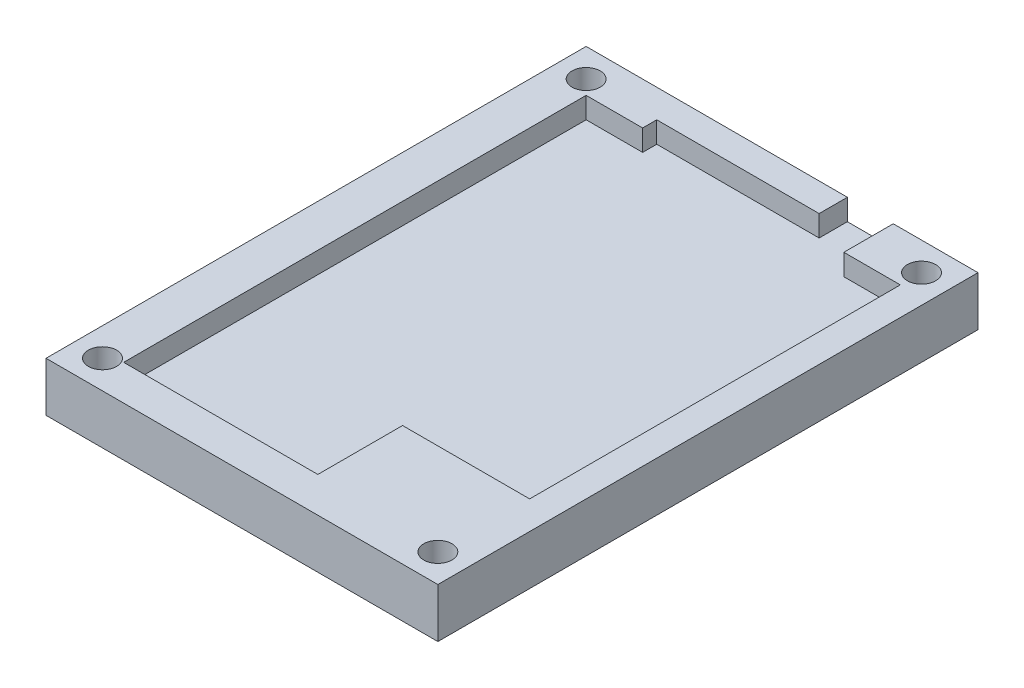
ISO-10303-21;
HEADER;
FILE_DESCRIPTION(('STEP AP214'),'2;1');
FILE_NAME('part.step','',(''),(''),'','','');
FILE_SCHEMA(('AUTOMOTIVE_DESIGN { 1 0 10303 214 1 1 1 1 }'));
ENDSEC;
DATA;
#1=APPLICATION_CONTEXT('core data for automotive mechanical design processes');
#2=APPLICATION_PROTOCOL_DEFINITION('international standard','automotive_design',2000,#1);
#3=PRODUCT_CONTEXT('',#1,'mechanical');
#4=PRODUCT('Part','Part','',(#3));
#5=PRODUCT_RELATED_PRODUCT_CATEGORY('part','',(#4));
#6=PRODUCT_DEFINITION_FORMATION('','',#4);
#7=PRODUCT_DEFINITION_CONTEXT('part definition',#1,'design');
#8=PRODUCT_DEFINITION('design','',#6,#7);
#9=PRODUCT_DEFINITION_SHAPE('','',#8);
#10=(LENGTH_UNIT() NAMED_UNIT(*) SI_UNIT(.MILLI.,.METRE.));
#11=(NAMED_UNIT(*) PLANE_ANGLE_UNIT() SI_UNIT($,.RADIAN.));
#12=(NAMED_UNIT(*) SI_UNIT($,.STERADIAN.) SOLID_ANGLE_UNIT());
#13=UNCERTAINTY_MEASURE_WITH_UNIT(LENGTH_MEASURE(1.E-05),#10,'distance_accuracy_value','');
#14=(GEOMETRIC_REPRESENTATION_CONTEXT(3) GLOBAL_UNCERTAINTY_ASSIGNED_CONTEXT((#13)) GLOBAL_UNIT_ASSIGNED_CONTEXT((#10,
#11,#12)) REPRESENTATION_CONTEXT('',''));
#15=CARTESIAN_POINT('',(0.,0.,0.));
#16=DIRECTION('',(0.,0.,1.));
#17=DIRECTION('',(1.,0.,0.));
#18=AXIS2_PLACEMENT_3D('',#15,#16,#17);
#19=CARTESIAN_POINT('',(0.,7.,0.));
#20=DIRECTION('',(0.,-1.,0.));
#21=DIRECTION('',(0.,0.,-1.));
#22=AXIS2_PLACEMENT_3D('',#19,#20,#21);
#23=PLANE('',#22);
#24=DIRECTION('',(-1.,0.,0.));
#25=VECTOR('',#24,1.);
#26=CARTESIAN_POINT('',(-21.4896030245747,7.,-26.2693761814745));
#27=LINE('',#26,#25);
#28=CARTESIAN_POINT('',(15.5103969754253,7.,-26.2693761814745));
#29=VERTEX_POINT('',#28);
#30=CARTESIAN_POINT('',(-21.4896030245747,7.,-26.2693761814745));
#31=VERTEX_POINT('',#30);
#32=EDGE_CURVE('E149',#29,#31,#27,.T.);
#33=ORIENTED_EDGE('',*,*,#32,.T.);
#34=DIRECTION('',(0.,0.,1.));
#35=VECTOR('',#34,1.);
#36=CARTESIAN_POINT('',(-21.4896030245747,7.,-26.2693761814745));
#37=LINE('',#36,#35);
#38=CARTESIAN_POINT('',(-21.4896030245747,7.,50.2306238185255));
#39=VERTEX_POINT('',#38);
#40=EDGE_CURVE('E160',#31,#39,#37,.T.);
#41=ORIENTED_EDGE('',*,*,#40,.T.);
#42=DIRECTION('',(1.,0.,0.));
#43=VECTOR('',#42,1.);
#44=CARTESIAN_POINT('',(-21.4896030245747,7.,50.2306238185255));
#45=LINE('',#44,#43);
#46=CARTESIAN_POINT('',(34.0103969754254,7.,50.2306238185255));
#47=VERTEX_POINT('',#46);
#48=EDGE_CURVE('E164',#39,#47,#45,.T.);
#49=ORIENTED_EDGE('',*,*,#48,.T.);
#50=DIRECTION('',(0.,0.,-1.));
#51=VECTOR('',#50,1.);
#52=CARTESIAN_POINT('',(34.0103969754254,7.,-26.2693761814745));
#53=LINE('',#52,#51);
#54=CARTESIAN_POINT('',(34.0103969754254,7.,-26.2693761814745));
#55=VERTEX_POINT('',#54);
#56=EDGE_CURVE('E177',#47,#55,#53,.T.);
#57=ORIENTED_EDGE('',*,*,#56,.T.);
#58=DIRECTION('',(-1.,0.,0.));
#59=VECTOR('',#58,1.);
#60=CARTESIAN_POINT('',(34.0103969754254,7.,-26.2693761814745));
#61=LINE('',#60,#59);
#62=CARTESIAN_POINT('',(22.0103969754254,7.,-26.2693761814745));
#63=VERTEX_POINT('',#62);
#64=EDGE_CURVE('E180',#55,#63,#61,.T.);
#65=ORIENTED_EDGE('',*,*,#64,.T.);
#66=DIRECTION('',(0.,0.,1.));
#67=VECTOR('',#66,1.);
#68=CARTESIAN_POINT('',(22.0103969754254,7.,-26.2693761814745));
#69=LINE('',#68,#67);
#70=CARTESIAN_POINT('',(22.0103969754254,7.,-19.2693761814745));
#71=VERTEX_POINT('',#70);
#72=EDGE_CURVE('E182',#63,#71,#69,.T.);
#73=ORIENTED_EDGE('',*,*,#72,.T.);
#74=DIRECTION('',(1.,0.,0.));
#75=VECTOR('',#74,1.);
#76=CARTESIAN_POINT('',(30.0103969754254,7.,-19.2693761814745));
#77=LINE('',#76,#75);
#78=CARTESIAN_POINT('',(30.0103969754254,7.,-19.2693761814745));
#79=VERTEX_POINT('',#78);
#80=EDGE_CURVE('E184',#71,#79,#77,.T.);
#81=ORIENTED_EDGE('',*,*,#80,.T.);
#82=DIRECTION('',(0.,0.,1.));
#83=VECTOR('',#82,1.);
#84=CARTESIAN_POINT('',(30.0103969754254,7.,33.2306238185255));
#85=LINE('',#84,#83);
#86=CARTESIAN_POINT('',(30.0103969754254,7.,33.2306238185255));
#87=VERTEX_POINT('',#86);
#88=EDGE_CURVE('E186',#79,#87,#85,.T.);
#89=ORIENTED_EDGE('',*,*,#88,.T.);
#90=DIRECTION('',(-1.,0.,0.));
#91=VECTOR('',#90,1.);
#92=CARTESIAN_POINT('',(30.0103969754254,7.,33.2306238185255));
#93=LINE('',#92,#91);
#94=CARTESIAN_POINT('',(12.0103969754254,7.,33.2306238185255));
#95=VERTEX_POINT('',#94);
#96=EDGE_CURVE('E188',#87,#95,#93,.T.);
#97=ORIENTED_EDGE('',*,*,#96,.T.);
#98=DIRECTION('',(0.,0.,1.));
#99=VECTOR('',#98,1.);
#100=CARTESIAN_POINT('',(12.0103969754254,7.,45.2306238185255));
#101=LINE('',#100,#99);
#102=CARTESIAN_POINT('',(12.0103969754254,7.,45.2306238185255));
#103=VERTEX_POINT('',#102);
#104=EDGE_CURVE('E190',#95,#103,#101,.T.);
#105=ORIENTED_EDGE('',*,*,#104,.T.);
#106=DIRECTION('',(-1.,0.,0.));
#107=VECTOR('',#106,1.);
#108=CARTESIAN_POINT('',(-15.4896030245747,7.,45.2306238185255));
#109=LINE('',#108,#107);
#110=CARTESIAN_POINT('',(-15.4896030245747,7.,45.2306238185255));
#111=VERTEX_POINT('',#110);
#112=EDGE_CURVE('E192',#103,#111,#109,.T.);
#113=ORIENTED_EDGE('',*,*,#112,.T.);
#114=DIRECTION('',(0.,0.,-1.));
#115=VECTOR('',#114,1.);
#116=CARTESIAN_POINT('',(-15.4896030245747,7.,-20.2693761814745));
#117=LINE('',#116,#115);
#118=CARTESIAN_POINT('',(-15.4896030245747,7.,-20.2693761814745));
#119=VERTEX_POINT('',#118);
#120=EDGE_CURVE('E194',#111,#119,#117,.T.);
#121=ORIENTED_EDGE('',*,*,#120,.T.);
#122=DIRECTION('',(1.,0.,0.));
#123=VECTOR('',#122,1.);
#124=CARTESIAN_POINT('',(-15.4896030245747,7.,-20.2693761814745));
#125=LINE('',#124,#123);
#126=CARTESIAN_POINT('',(-7.48960302457466,7.,-20.2693761814745));
#127=VERTEX_POINT('',#126);
#128=EDGE_CURVE('E196',#119,#127,#125,.T.);
#129=ORIENTED_EDGE('',*,*,#128,.T.);
#130=DIRECTION('',(0.,0.,-1.));
#131=VECTOR('',#130,1.);
#132=CARTESIAN_POINT('',(-7.48960302457466,7.,-22.2693761814745));
#133=LINE('',#132,#131);
#134=CARTESIAN_POINT('',(-7.48960302457466,7.,-22.2693761814745));
#135=VERTEX_POINT('',#134);
#136=EDGE_CURVE('E198',#127,#135,#133,.T.);
#137=ORIENTED_EDGE('',*,*,#136,.T.);
#138=DIRECTION('',(1.,0.,0.));
#139=VECTOR('',#138,1.);
#140=CARTESIAN_POINT('',(-7.48960302457466,7.,-22.2693761814745));
#141=LINE('',#140,#139);
#142=CARTESIAN_POINT('',(15.5103969754253,7.,-22.2693761814745));
#143=VERTEX_POINT('',#142);
#144=EDGE_CURVE('E200',#135,#143,#141,.T.);
#145=ORIENTED_EDGE('',*,*,#144,.T.);
#146=DIRECTION('',(0.,0.,-1.));
#147=VECTOR('',#146,1.);
#148=CARTESIAN_POINT('',(15.5103969754253,7.,-26.2693761814745));
#149=LINE('',#148,#147);
#150=EDGE_CURVE('E168',#143,#29,#149,.T.);
#151=ORIENTED_EDGE('',*,*,#150,.T.);
#152=EDGE_LOOP('',(#33,#41,#49,#57,#65,#73,#81,#89,#97,#105,#113,#121,#129,#137,#145,#151));
#153=FACE_BOUND('',#152,.T.);
#154=CARTESIAN_POINT('',(-17.4896030245747,7.,-22.2693761814745));
#155=DIRECTION('',(0.,1.,0.));
#156=DIRECTION('',(0.,0.,1.));
#157=AXIS2_PLACEMENT_3D('',#154,#155,#156);
#158=CIRCLE('',#157,1.99999999999999);
#159=CARTESIAN_POINT('',(-17.4896030245747,7.,-20.2693761814745));
#160=VERTEX_POINT('',#159);
#161=EDGE_CURVE('E378',#160,#160,#158,.T.);
#162=ORIENTED_EDGE('',*,*,#161,.F.);
#163=EDGE_LOOP('',(#162));
#164=FACE_BOUND('',#163,.T.);
#165=CARTESIAN_POINT('',(-17.4896030245747,7.,46.2306238185255));
#166=DIRECTION('',(0.,1.,0.));
#167=DIRECTION('',(0.,0.,1.));
#168=AXIS2_PLACEMENT_3D('',#165,#166,#167);
#169=CIRCLE('',#168,1.99999999999999);
#170=CARTESIAN_POINT('',(-17.4896030245747,7.,48.2306238185255));
#171=VERTEX_POINT('',#170);
#172=EDGE_CURVE('E373',#171,#171,#169,.T.);
#173=ORIENTED_EDGE('',*,*,#172,.F.);
#174=EDGE_LOOP('',(#173));
#175=FACE_BOUND('',#174,.T.);
#176=CARTESIAN_POINT('',(30.0103969754254,7.,46.2306238185255));
#177=DIRECTION('',(0.,1.,0.));
#178=DIRECTION('',(0.,0.,1.));
#179=AXIS2_PLACEMENT_3D('',#176,#177,#178);
#180=CIRCLE('',#179,1.99999999999999);
#181=CARTESIAN_POINT('',(30.0103969754254,7.,48.2306238185255));
#182=VERTEX_POINT('',#181);
#183=EDGE_CURVE('E365',#182,#182,#180,.T.);
#184=ORIENTED_EDGE('',*,*,#183,.F.);
#185=EDGE_LOOP('',(#184));
#186=FACE_BOUND('',#185,.T.);
#187=CARTESIAN_POINT('',(30.0103969754254,7.,-22.2693761814745));
#188=DIRECTION('',(0.,1.,0.));
#189=DIRECTION('',(0.,0.,1.));
#190=AXIS2_PLACEMENT_3D('',#187,#188,#189);
#191=CIRCLE('',#190,1.99999999999998);
#192=CARTESIAN_POINT('',(30.0103969754254,7.,-20.2693761814745));
#193=VERTEX_POINT('',#192);
#194=EDGE_CURVE('E362',#193,#193,#191,.T.);
#195=ORIENTED_EDGE('',*,*,#194,.F.);
#196=EDGE_LOOP('',(#195));
#197=FACE_BOUND('',#196,.T.);
#198=ADVANCED_FACE('F33',(#153,#164,#175,#186,#197),#23,.F.);
#199=CARTESIAN_POINT('',(-21.4896030245747,4.,-26.2693761814745));
#200=DIRECTION('',(1.,0.,0.));
#201=DIRECTION('',(0.,0.,-1.));
#202=AXIS2_PLACEMENT_3D('',#199,#200,#201);
#203=PLANE('',#202);
#204=DIRECTION('',(0.,0.,1.));
#205=VECTOR('',#204,1.);
#206=CARTESIAN_POINT('',(-21.4896030245747,0.,-26.2693761814745));
#207=LINE('',#206,#205);
#208=CARTESIAN_POINT('',(-21.4896030245747,0.,-26.2693761814745));
#209=VERTEX_POINT('',#208);
#210=CARTESIAN_POINT('',(-21.4896030245747,0.,50.2306238185255));
#211=VERTEX_POINT('',#210);
#212=EDGE_CURVE('E265',#209,#211,#207,.T.);
#213=ORIENTED_EDGE('',*,*,#212,.T.);
#214=DIRECTION('',(0.,-1.,0.));
#215=VECTOR('',#214,1.);
#216=CARTESIAN_POINT('',(-21.4896030245747,4.,50.2306238185255));
#217=LINE('',#216,#215);
#218=EDGE_CURVE('E11',#39,#211,#217,.T.);
#219=ORIENTED_EDGE('',*,*,#218,.F.);
#220=ORIENTED_EDGE('',*,*,#40,.F.);
#221=DIRECTION('',(0.,-1.,0.));
#222=VECTOR('',#221,1.);
#223=CARTESIAN_POINT('',(-21.4896030245747,4.,-26.2693761814745));
#224=LINE('',#223,#222);
#225=EDGE_CURVE('E144',#31,#209,#224,.T.);
#226=ORIENTED_EDGE('',*,*,#225,.T.);
#227=EDGE_LOOP('',(#213,#219,#220,#226));
#228=FACE_BOUND('',#227,.T.);
#229=ADVANCED_FACE('F35',(#228),#203,.F.);
#230=CARTESIAN_POINT('',(-21.4896030245747,4.,50.2306238185255));
#231=DIRECTION('',(0.,0.,-1.));
#232=DIRECTION('',(-1.,0.,0.));
#233=AXIS2_PLACEMENT_3D('',#230,#231,#232);
#234=PLANE('',#233);
#235=DIRECTION('',(1.,0.,0.));
#236=VECTOR('',#235,1.);
#237=CARTESIAN_POINT('',(-21.4896030245747,0.,50.2306238185255));
#238=LINE('',#237,#236);
#239=CARTESIAN_POINT('',(34.0103969754254,0.,50.2306238185255));
#240=VERTEX_POINT('',#239);
#241=EDGE_CURVE('E268',#211,#240,#238,.T.);
#242=ORIENTED_EDGE('',*,*,#241,.T.);
#243=DIRECTION('',(0.,-1.,0.));
#244=VECTOR('',#243,1.);
#245=CARTESIAN_POINT('',(34.0103969754254,4.,50.2306238185255));
#246=LINE('',#245,#244);
#247=EDGE_CURVE('E41',#47,#240,#246,.T.);
#248=ORIENTED_EDGE('',*,*,#247,.F.);
#249=ORIENTED_EDGE('',*,*,#48,.F.);
#250=ORIENTED_EDGE('',*,*,#218,.T.);
#251=EDGE_LOOP('',(#242,#248,#249,#250));
#252=FACE_BOUND('',#251,.T.);
#253=ADVANCED_FACE('F281',(#252),#234,.F.);
#254=CARTESIAN_POINT('',(34.0103969754253,4.,-26.2693761814745));
#255=DIRECTION('',(-1.,0.,0.));
#256=DIRECTION('',(0.,0.,1.));
#257=AXIS2_PLACEMENT_3D('',#254,#255,#256);
#258=PLANE('',#257);
#259=DIRECTION('',(0.,0.,-1.));
#260=VECTOR('',#259,1.);
#261=CARTESIAN_POINT('',(34.0103969754253,0.,-26.2693761814745));
#262=LINE('',#261,#260);
#263=CARTESIAN_POINT('',(34.0103969754253,0.,-26.2693761814745));
#264=VERTEX_POINT('',#263);
#265=EDGE_CURVE('E270',#240,#264,#262,.T.);
#266=ORIENTED_EDGE('',*,*,#265,.T.);
#267=DIRECTION('',(0.,-1.,0.));
#268=VECTOR('',#267,1.);
#269=CARTESIAN_POINT('',(34.0103969754253,4.,-26.2693761814745));
#270=LINE('',#269,#268);
#271=EDGE_CURVE('E156',#55,#264,#270,.T.);
#272=ORIENTED_EDGE('',*,*,#271,.F.);
#273=ORIENTED_EDGE('',*,*,#56,.F.);
#274=ORIENTED_EDGE('',*,*,#247,.T.);
#275=EDGE_LOOP('',(#266,#272,#273,#274));
#276=FACE_BOUND('',#275,.T.);
#277=ADVANCED_FACE('F277',(#276),#258,.F.);
#278=CARTESIAN_POINT('',(-21.4896030245747,4.,-26.2693761814745));
#279=DIRECTION('',(0.,0.,1.));
#280=DIRECTION('',(1.,0.,0.));
#281=AXIS2_PLACEMENT_3D('',#278,#279,#280);
#282=PLANE('',#281);
#283=DIRECTION('',(-1.,0.,0.));
#284=VECTOR('',#283,1.);
#285=CARTESIAN_POINT('',(-21.4896030245747,0.,-26.2693761814745));
#286=LINE('',#285,#284);
#287=EDGE_CURVE('E152',#264,#209,#286,.T.);
#288=ORIENTED_EDGE('',*,*,#287,.T.);
#289=ORIENTED_EDGE('',*,*,#225,.F.);
#290=ORIENTED_EDGE('',*,*,#32,.F.);
#291=DIRECTION('',(0.,-1.,0.));
#292=VECTOR('',#291,1.);
#293=CARTESIAN_POINT('',(15.5103969754253,7.,-26.2693761814745));
#294=LINE('',#293,#292);
#295=CARTESIAN_POINT('',(15.5103969754253,4.,-26.2693761814745));
#296=VERTEX_POINT('',#295);
#297=EDGE_CURVE('E203',#29,#296,#294,.T.);
#298=ORIENTED_EDGE('',*,*,#297,.T.);
#299=DIRECTION('',(-1.,0.,0.));
#300=VECTOR('',#299,1.);
#301=CARTESIAN_POINT('',(-21.4896030245747,4.,-26.2693761814745));
#302=LINE('',#301,#300);
#303=CARTESIAN_POINT('',(22.0103969754253,4.,-26.2693761814745));
#304=VERTEX_POINT('',#303);
#305=EDGE_CURVE('E157',#304,#296,#302,.T.);
#306=ORIENTED_EDGE('',*,*,#305,.F.);
#307=DIRECTION('',(0.,-1.,0.));
#308=VECTOR('',#307,1.);
#309=CARTESIAN_POINT('',(22.0103969754254,7.,-26.2693761814745));
#310=LINE('',#309,#308);
#311=EDGE_CURVE('E262',#63,#304,#310,.T.);
#312=ORIENTED_EDGE('',*,*,#311,.F.);
#313=ORIENTED_EDGE('',*,*,#64,.F.);
#314=ORIENTED_EDGE('',*,*,#271,.T.);
#315=EDGE_LOOP('',(#288,#289,#290,#298,#306,#312,#313,#314));
#316=FACE_BOUND('',#315,.T.);
#317=ADVANCED_FACE('F146',(#316),#282,.F.);
#318=CARTESIAN_POINT('',(0.,4.,0.));
#319=DIRECTION('',(0.,1.,0.));
#320=DIRECTION('',(0.,0.,1.));
#321=AXIS2_PLACEMENT_3D('',#318,#319,#320);
#322=PLANE('',#321);
#323=DIRECTION('',(0.,0.,-1.));
#324=VECTOR('',#323,1.);
#325=CARTESIAN_POINT('',(15.5103969754253,4.,-26.2693761814745));
#326=LINE('',#325,#324);
#327=CARTESIAN_POINT('',(15.5103969754253,4.,-22.2693761814745));
#328=VERTEX_POINT('',#327);
#329=EDGE_CURVE('E48',#328,#296,#326,.T.);
#330=ORIENTED_EDGE('',*,*,#329,.F.);
#331=DIRECTION('',(1.,0.,0.));
#332=VECTOR('',#331,1.);
#333=CARTESIAN_POINT('',(-7.48960302457466,4.,-22.2693761814745));
#334=LINE('',#333,#332);
#335=CARTESIAN_POINT('',(-7.48960302457466,4.,-22.2693761814745));
#336=VERTEX_POINT('',#335);
#337=EDGE_CURVE('E52',#336,#328,#334,.T.);
#338=ORIENTED_EDGE('',*,*,#337,.F.);
#339=DIRECTION('',(0.,0.,-1.));
#340=VECTOR('',#339,1.);
#341=CARTESIAN_POINT('',(-7.48960302457466,4.,-22.2693761814745));
#342=LINE('',#341,#340);
#343=CARTESIAN_POINT('',(-7.48960302457466,4.,-20.2693761814745));
#344=VERTEX_POINT('',#343);
#345=EDGE_CURVE('E228',#344,#336,#342,.T.);
#346=ORIENTED_EDGE('',*,*,#345,.F.);
#347=DIRECTION('',(1.,0.,0.));
#348=VECTOR('',#347,1.);
#349=CARTESIAN_POINT('',(-15.4896030245747,4.,-20.2693761814745));
#350=LINE('',#349,#348);
#351=CARTESIAN_POINT('',(-15.4896030245747,4.,-20.2693761814745));
#352=VERTEX_POINT('',#351);
#353=EDGE_CURVE('E225',#352,#344,#350,.T.);
#354=ORIENTED_EDGE('',*,*,#353,.F.);
#355=DIRECTION('',(0.,0.,-1.));
#356=VECTOR('',#355,1.);
#357=CARTESIAN_POINT('',(-15.4896030245747,4.,-20.2693761814745));
#358=LINE('',#357,#356);
#359=CARTESIAN_POINT('',(-15.4896030245747,4.,45.2306238185255));
#360=VERTEX_POINT('',#359);
#361=EDGE_CURVE('E222',#360,#352,#358,.T.);
#362=ORIENTED_EDGE('',*,*,#361,.F.);
#363=DIRECTION('',(-1.,0.,0.));
#364=VECTOR('',#363,1.);
#365=CARTESIAN_POINT('',(-15.4896030245747,4.,45.2306238185255));
#366=LINE('',#365,#364);
#367=CARTESIAN_POINT('',(12.0103969754254,4.,45.2306238185255));
#368=VERTEX_POINT('',#367);
#369=EDGE_CURVE('E219',#368,#360,#366,.T.);
#370=ORIENTED_EDGE('',*,*,#369,.F.);
#371=DIRECTION('',(0.,0.,1.));
#372=VECTOR('',#371,1.);
#373=CARTESIAN_POINT('',(12.0103969754254,4.,45.2306238185255));
#374=LINE('',#373,#372);
#375=CARTESIAN_POINT('',(12.0103969754254,4.,33.2306238185255));
#376=VERTEX_POINT('',#375);
#377=EDGE_CURVE('E216',#376,#368,#374,.T.);
#378=ORIENTED_EDGE('',*,*,#377,.F.);
#379=DIRECTION('',(-1.,0.,0.));
#380=VECTOR('',#379,1.);
#381=CARTESIAN_POINT('',(30.0103969754254,4.,33.2306238185255));
#382=LINE('',#381,#380);
#383=CARTESIAN_POINT('',(30.0103969754254,4.,33.2306238185255));
#384=VERTEX_POINT('',#383);
#385=EDGE_CURVE('E213',#384,#376,#382,.T.);
#386=ORIENTED_EDGE('',*,*,#385,.F.);
#387=DIRECTION('',(0.,0.,1.));
#388=VECTOR('',#387,1.);
#389=CARTESIAN_POINT('',(30.0103969754254,4.,33.2306238185255));
#390=LINE('',#389,#388);
#391=CARTESIAN_POINT('',(30.0103969754254,4.,-19.2693761814745));
#392=VERTEX_POINT('',#391);
#393=EDGE_CURVE('E210',#392,#384,#390,.T.);
#394=ORIENTED_EDGE('',*,*,#393,.F.);
#395=DIRECTION('',(1.,0.,0.));
#396=VECTOR('',#395,1.);
#397=CARTESIAN_POINT('',(30.0103969754254,4.,-19.2693761814745));
#398=LINE('',#397,#396);
#399=CARTESIAN_POINT('',(22.0103969754254,4.,-19.2693761814745));
#400=VERTEX_POINT('',#399);
#401=EDGE_CURVE('E207',#400,#392,#398,.T.);
#402=ORIENTED_EDGE('',*,*,#401,.F.);
#403=DIRECTION('',(0.,0.,1.));
#404=VECTOR('',#403,1.);
#405=CARTESIAN_POINT('',(22.0103969754254,4.,-26.2693761814745));
#406=LINE('',#405,#404);
#407=EDGE_CURVE('E204',#304,#400,#406,.T.);
#408=ORIENTED_EDGE('',*,*,#407,.F.);
#409=ORIENTED_EDGE('',*,*,#305,.T.);
#410=EDGE_LOOP('',(#330,#338,#346,#354,#362,#370,#378,#386,#394,#402,#408,#409));
#411=FACE_BOUND('',#410,.T.);
#412=ADVANCED_FACE('F386',(#411),#322,.T.);
#413=CARTESIAN_POINT('',(0.,0.,0.));
#414=DIRECTION('',(0.,1.,0.));
#415=DIRECTION('',(0.,0.,1.));
#416=AXIS2_PLACEMENT_3D('',#413,#414,#415);
#417=PLANE('',#416);
#418=CARTESIAN_POINT('',(30.0103969754254,0.,-22.2693761814745));
#419=DIRECTION('',(0.,1.,0.));
#420=DIRECTION('',(0.,0.,1.));
#421=AXIS2_PLACEMENT_3D('',#418,#419,#420);
#422=CIRCLE('',#421,1.99999999999999);
#423=CARTESIAN_POINT('',(30.0103969754254,0.,-20.2693761814745));
#424=VERTEX_POINT('',#423);
#425=EDGE_CURVE('E359',#424,#424,#422,.T.);
#426=ORIENTED_EDGE('',*,*,#425,.T.);
#427=EDGE_LOOP('',(#426));
#428=FACE_BOUND('',#427,.T.);
#429=CARTESIAN_POINT('',(30.0103969754254,0.,46.2306238185255));
#430=DIRECTION('',(0.,1.,0.));
#431=DIRECTION('',(0.,0.,1.));
#432=AXIS2_PLACEMENT_3D('',#429,#430,#431);
#433=CIRCLE('',#432,1.99999999999999);
#434=CARTESIAN_POINT('',(30.0103969754254,0.,48.2306238185255));
#435=VERTEX_POINT('',#434);
#436=EDGE_CURVE('E370',#435,#435,#433,.T.);
#437=ORIENTED_EDGE('',*,*,#436,.T.);
#438=EDGE_LOOP('',(#437));
#439=FACE_BOUND('',#438,.T.);
#440=CARTESIAN_POINT('',(-17.4896030245747,0.,46.2306238185255));
#441=DIRECTION('',(0.,1.,0.));
#442=DIRECTION('',(0.,0.,1.));
#443=AXIS2_PLACEMENT_3D('',#440,#441,#442);
#444=CIRCLE('',#443,1.99999999999999);
#445=CARTESIAN_POINT('',(-17.4896030245747,0.,48.2306238185255));
#446=VERTEX_POINT('',#445);
#447=EDGE_CURVE('E376',#446,#446,#444,.T.);
#448=ORIENTED_EDGE('',*,*,#447,.T.);
#449=EDGE_LOOP('',(#448));
#450=FACE_BOUND('',#449,.T.);
#451=CARTESIAN_POINT('',(-17.4896030245747,0.,-22.2693761814745));
#452=DIRECTION('',(0.,1.,0.));
#453=DIRECTION('',(0.,0.,1.));
#454=AXIS2_PLACEMENT_3D('',#451,#452,#453);
#455=CIRCLE('',#454,1.99999999999999);
#456=CARTESIAN_POINT('',(-17.4896030245747,0.,-20.2693761814745));
#457=VERTEX_POINT('',#456);
#458=EDGE_CURVE('E173',#457,#457,#455,.T.);
#459=ORIENTED_EDGE('',*,*,#458,.T.);
#460=EDGE_LOOP('',(#459));
#461=FACE_BOUND('',#460,.T.);
#462=ORIENTED_EDGE('',*,*,#212,.F.);
#463=ORIENTED_EDGE('',*,*,#287,.F.);
#464=ORIENTED_EDGE('',*,*,#265,.F.);
#465=ORIENTED_EDGE('',*,*,#241,.F.);
#466=EDGE_LOOP('',(#462,#463,#464,#465));
#467=FACE_BOUND('',#466,.T.);
#468=ADVANCED_FACE('F280',(#428,#439,#450,#461,#467),#417,.F.);
#469=CARTESIAN_POINT('',(22.0103969754254,7.,-26.2693761814745));
#470=DIRECTION('',(1.,0.,0.));
#471=DIRECTION('',(0.,0.,-1.));
#472=AXIS2_PLACEMENT_3D('',#469,#470,#471);
#473=PLANE('',#472);
#474=ORIENTED_EDGE('',*,*,#407,.T.);
#475=DIRECTION('',(0.,-1.,0.));
#476=VECTOR('',#475,1.);
#477=CARTESIAN_POINT('',(22.0103969754254,7.,-19.2693761814745));
#478=LINE('',#477,#476);
#479=EDGE_CURVE('E259',#71,#400,#478,.T.);
#480=ORIENTED_EDGE('',*,*,#479,.F.);
#481=ORIENTED_EDGE('',*,*,#72,.F.);
#482=ORIENTED_EDGE('',*,*,#311,.T.);
#483=EDGE_LOOP('',(#474,#480,#481,#482));
#484=FACE_BOUND('',#483,.T.);
#485=ADVANCED_FACE('F288',(#484),#473,.F.);
#486=CARTESIAN_POINT('',(30.0103969754254,7.,-19.2693761814745));
#487=DIRECTION('',(0.,0.,-1.));
#488=DIRECTION('',(-1.,0.,0.));
#489=AXIS2_PLACEMENT_3D('',#486,#487,#488);
#490=PLANE('',#489);
#491=ORIENTED_EDGE('',*,*,#401,.T.);
#492=DIRECTION('',(0.,-1.,0.));
#493=VECTOR('',#492,1.);
#494=CARTESIAN_POINT('',(30.0103969754254,7.,-19.2693761814745));
#495=LINE('',#494,#493);
#496=EDGE_CURVE('E256',#79,#392,#495,.T.);
#497=ORIENTED_EDGE('',*,*,#496,.F.);
#498=ORIENTED_EDGE('',*,*,#80,.F.);
#499=ORIENTED_EDGE('',*,*,#479,.T.);
#500=EDGE_LOOP('',(#491,#497,#498,#499));
#501=FACE_BOUND('',#500,.T.);
#502=ADVANCED_FACE('F294',(#501),#490,.F.);
#503=CARTESIAN_POINT('',(30.0103969754254,7.,33.2306238185255));
#504=DIRECTION('',(1.,0.,0.));
#505=DIRECTION('',(0.,0.,-1.));
#506=AXIS2_PLACEMENT_3D('',#503,#504,#505);
#507=PLANE('',#506);
#508=ORIENTED_EDGE('',*,*,#393,.T.);
#509=DIRECTION('',(0.,-1.,0.));
#510=VECTOR('',#509,1.);
#511=CARTESIAN_POINT('',(30.0103969754254,7.,33.2306238185255));
#512=LINE('',#511,#510);
#513=EDGE_CURVE('E253',#87,#384,#512,.T.);
#514=ORIENTED_EDGE('',*,*,#513,.F.);
#515=ORIENTED_EDGE('',*,*,#88,.F.);
#516=ORIENTED_EDGE('',*,*,#496,.T.);
#517=EDGE_LOOP('',(#508,#514,#515,#516));
#518=FACE_BOUND('',#517,.T.);
#519=ADVANCED_FACE('F296',(#518),#507,.F.);
#520=CARTESIAN_POINT('',(30.0103969754254,7.,33.2306238185255));
#521=DIRECTION('',(0.,0.,1.));
#522=DIRECTION('',(1.,0.,0.));
#523=AXIS2_PLACEMENT_3D('',#520,#521,#522);
#524=PLANE('',#523);
#525=ORIENTED_EDGE('',*,*,#385,.T.);
#526=DIRECTION('',(0.,-1.,0.));
#527=VECTOR('',#526,1.);
#528=CARTESIAN_POINT('',(12.0103969754254,7.,33.2306238185255));
#529=LINE('',#528,#527);
#530=EDGE_CURVE('E250',#95,#376,#529,.T.);
#531=ORIENTED_EDGE('',*,*,#530,.F.);
#532=ORIENTED_EDGE('',*,*,#96,.F.);
#533=ORIENTED_EDGE('',*,*,#513,.T.);
#534=EDGE_LOOP('',(#525,#531,#532,#533));
#535=FACE_BOUND('',#534,.T.);
#536=ADVANCED_FACE('F300',(#535),#524,.F.);
#537=CARTESIAN_POINT('',(12.0103969754254,7.,45.2306238185255));
#538=DIRECTION('',(1.,0.,0.));
#539=DIRECTION('',(0.,0.,-1.));
#540=AXIS2_PLACEMENT_3D('',#537,#538,#539);
#541=PLANE('',#540);
#542=ORIENTED_EDGE('',*,*,#377,.T.);
#543=DIRECTION('',(0.,-1.,0.));
#544=VECTOR('',#543,1.);
#545=CARTESIAN_POINT('',(12.0103969754254,7.,45.2306238185255));
#546=LINE('',#545,#544);
#547=EDGE_CURVE('E247',#103,#368,#546,.T.);
#548=ORIENTED_EDGE('',*,*,#547,.F.);
#549=ORIENTED_EDGE('',*,*,#104,.F.);
#550=ORIENTED_EDGE('',*,*,#530,.T.);
#551=EDGE_LOOP('',(#542,#548,#549,#550));
#552=FACE_BOUND('',#551,.T.);
#553=ADVANCED_FACE('F306',(#552),#541,.F.);
#554=CARTESIAN_POINT('',(-15.4896030245747,7.,45.2306238185255));
#555=DIRECTION('',(0.,0.,1.));
#556=DIRECTION('',(1.,0.,0.));
#557=AXIS2_PLACEMENT_3D('',#554,#555,#556);
#558=PLANE('',#557);
#559=ORIENTED_EDGE('',*,*,#369,.T.);
#560=DIRECTION('',(0.,-1.,0.));
#561=VECTOR('',#560,1.);
#562=CARTESIAN_POINT('',(-15.4896030245747,7.,45.2306238185255));
#563=LINE('',#562,#561);
#564=EDGE_CURVE('E244',#111,#360,#563,.T.);
#565=ORIENTED_EDGE('',*,*,#564,.F.);
#566=ORIENTED_EDGE('',*,*,#112,.F.);
#567=ORIENTED_EDGE('',*,*,#547,.T.);
#568=EDGE_LOOP('',(#559,#565,#566,#567));
#569=FACE_BOUND('',#568,.T.);
#570=ADVANCED_FACE('F308',(#569),#558,.F.);
#571=CARTESIAN_POINT('',(-15.4896030245747,7.,-20.2693761814745));
#572=DIRECTION('',(-1.,0.,0.));
#573=DIRECTION('',(0.,0.,1.));
#574=AXIS2_PLACEMENT_3D('',#571,#572,#573);
#575=PLANE('',#574);
#576=ORIENTED_EDGE('',*,*,#361,.T.);
#577=DIRECTION('',(0.,-1.,0.));
#578=VECTOR('',#577,1.);
#579=CARTESIAN_POINT('',(-15.4896030245747,7.,-20.2693761814745));
#580=LINE('',#579,#578);
#581=EDGE_CURVE('E241',#119,#352,#580,.T.);
#582=ORIENTED_EDGE('',*,*,#581,.F.);
#583=ORIENTED_EDGE('',*,*,#120,.F.);
#584=ORIENTED_EDGE('',*,*,#564,.T.);
#585=EDGE_LOOP('',(#576,#582,#583,#584));
#586=FACE_BOUND('',#585,.T.);
#587=ADVANCED_FACE('F312',(#586),#575,.F.);
#588=CARTESIAN_POINT('',(-15.4896030245747,7.,-20.2693761814745));
#589=DIRECTION('',(0.,0.,-1.));
#590=DIRECTION('',(-1.,0.,0.));
#591=AXIS2_PLACEMENT_3D('',#588,#589,#590);
#592=PLANE('',#591);
#593=ORIENTED_EDGE('',*,*,#353,.T.);
#594=DIRECTION('',(0.,-1.,0.));
#595=VECTOR('',#594,1.);
#596=CARTESIAN_POINT('',(-7.48960302457466,7.,-20.2693761814745));
#597=LINE('',#596,#595);
#598=EDGE_CURVE('E238',#127,#344,#597,.T.);
#599=ORIENTED_EDGE('',*,*,#598,.F.);
#600=ORIENTED_EDGE('',*,*,#128,.F.);
#601=ORIENTED_EDGE('',*,*,#581,.T.);
#602=EDGE_LOOP('',(#593,#599,#600,#601));
#603=FACE_BOUND('',#602,.T.);
#604=ADVANCED_FACE('F318',(#603),#592,.F.);
#605=CARTESIAN_POINT('',(-7.48960302457466,7.,-22.2693761814745));
#606=DIRECTION('',(-1.,0.,0.));
#607=DIRECTION('',(0.,0.,1.));
#608=AXIS2_PLACEMENT_3D('',#605,#606,#607);
#609=PLANE('',#608);
#610=ORIENTED_EDGE('',*,*,#345,.T.);
#611=DIRECTION('',(0.,-1.,0.));
#612=VECTOR('',#611,1.);
#613=CARTESIAN_POINT('',(-7.48960302457466,7.,-22.2693761814745));
#614=LINE('',#613,#612);
#615=EDGE_CURVE('E235',#135,#336,#614,.T.);
#616=ORIENTED_EDGE('',*,*,#615,.F.);
#617=ORIENTED_EDGE('',*,*,#136,.F.);
#618=ORIENTED_EDGE('',*,*,#598,.T.);
#619=EDGE_LOOP('',(#610,#616,#617,#618));
#620=FACE_BOUND('',#619,.T.);
#621=ADVANCED_FACE('F320',(#620),#609,.F.);
#622=CARTESIAN_POINT('',(-7.48960302457466,7.,-22.2693761814745));
#623=DIRECTION('',(0.,0.,-1.));
#624=DIRECTION('',(-1.,0.,0.));
#625=AXIS2_PLACEMENT_3D('',#622,#623,#624);
#626=PLANE('',#625);
#627=ORIENTED_EDGE('',*,*,#337,.T.);
#628=DIRECTION('',(0.,-1.,0.));
#629=VECTOR('',#628,1.);
#630=CARTESIAN_POINT('',(15.5103969754253,7.,-22.2693761814745));
#631=LINE('',#630,#629);
#632=EDGE_CURVE('E232',#143,#328,#631,.T.);
#633=ORIENTED_EDGE('',*,*,#632,.F.);
#634=ORIENTED_EDGE('',*,*,#144,.F.);
#635=ORIENTED_EDGE('',*,*,#615,.T.);
#636=EDGE_LOOP('',(#627,#633,#634,#635));
#637=FACE_BOUND('',#636,.T.);
#638=ADVANCED_FACE('F324',(#637),#626,.F.);
#639=CARTESIAN_POINT('',(15.5103969754253,7.,-26.2693761814745));
#640=DIRECTION('',(-1.,0.,0.));
#641=DIRECTION('',(0.,0.,1.));
#642=AXIS2_PLACEMENT_3D('',#639,#640,#641);
#643=PLANE('',#642);
#644=ORIENTED_EDGE('',*,*,#329,.T.);
#645=ORIENTED_EDGE('',*,*,#297,.F.);
#646=ORIENTED_EDGE('',*,*,#150,.F.);
#647=ORIENTED_EDGE('',*,*,#632,.T.);
#648=EDGE_LOOP('',(#644,#645,#646,#647));
#649=FACE_BOUND('',#648,.T.);
#650=ADVANCED_FACE('F326',(#649),#643,.F.);
#651=CARTESIAN_POINT('',(-17.4896030245747,7.,-22.2693761814745));
#652=DIRECTION('',(0.,1.,0.));
#653=DIRECTION('',(0.,0.,1.));
#654=AXIS2_PLACEMENT_3D('',#651,#652,#653);
#655=CYLINDRICAL_SURFACE('',#654,1.99999999999999);
#656=ORIENTED_EDGE('',*,*,#458,.F.);
#657=EDGE_LOOP('',(#656));
#658=FACE_BOUND('',#657,.T.);
#659=ORIENTED_EDGE('',*,*,#161,.T.);
#660=EDGE_LOOP('',(#659));
#661=FACE_BOUND('',#660,.T.);
#662=ADVANCED_FACE('F328',(#658,#661),#655,.F.);
#663=CARTESIAN_POINT('',(-17.4896030245747,7.,46.2306238185255));
#664=DIRECTION('',(0.,1.,0.));
#665=DIRECTION('',(0.,0.,1.));
#666=AXIS2_PLACEMENT_3D('',#663,#664,#665);
#667=CYLINDRICAL_SURFACE('',#666,1.99999999999999);
#668=ORIENTED_EDGE('',*,*,#447,.F.);
#669=EDGE_LOOP('',(#668));
#670=FACE_BOUND('',#669,.T.);
#671=ORIENTED_EDGE('',*,*,#172,.T.);
#672=EDGE_LOOP('',(#671));
#673=FACE_BOUND('',#672,.T.);
#674=ADVANCED_FACE('F334',(#670,#673),#667,.F.);
#675=CARTESIAN_POINT('',(30.0103969754254,7.,46.2306238185255));
#676=DIRECTION('',(0.,1.,0.));
#677=DIRECTION('',(0.,0.,1.));
#678=AXIS2_PLACEMENT_3D('',#675,#676,#677);
#679=CYLINDRICAL_SURFACE('',#678,1.99999999999999);
#680=ORIENTED_EDGE('',*,*,#436,.F.);
#681=EDGE_LOOP('',(#680));
#682=FACE_BOUND('',#681,.T.);
#683=ORIENTED_EDGE('',*,*,#183,.T.);
#684=EDGE_LOOP('',(#683));
#685=FACE_BOUND('',#684,.T.);
#686=ADVANCED_FACE('F346',(#682,#685),#679,.F.);
#687=CARTESIAN_POINT('',(30.0103969754254,7.,-22.2693761814745));
#688=DIRECTION('',(0.,1.,0.));
#689=DIRECTION('',(0.,0.,1.));
#690=AXIS2_PLACEMENT_3D('',#687,#688,#689);
#691=CYLINDRICAL_SURFACE('',#690,1.99999999999999);
#692=ORIENTED_EDGE('',*,*,#425,.F.);
#693=EDGE_LOOP('',(#692));
#694=FACE_BOUND('',#693,.T.);
#695=ORIENTED_EDGE('',*,*,#194,.T.);
#696=EDGE_LOOP('',(#695));
#697=FACE_BOUND('',#696,.T.);
#698=ADVANCED_FACE('F350',(#694,#697),#691,.F.);
#699=CLOSED_SHELL('',(#198,#229,#253,#277,#317,#412,#468,#485,#502,#519,#536,#553,#570,#587,
#604,#621,#638,#650,#662,#674,#686,#698));
#700=MANIFOLD_SOLID_BREP('B2',#699);
#701=ADVANCED_BREP_SHAPE_REPRESENTATION('',(#18,#700),#14);
#702=SHAPE_DEFINITION_REPRESENTATION(#9,#701);
ENDSEC;
END-ISO-10303-21;
